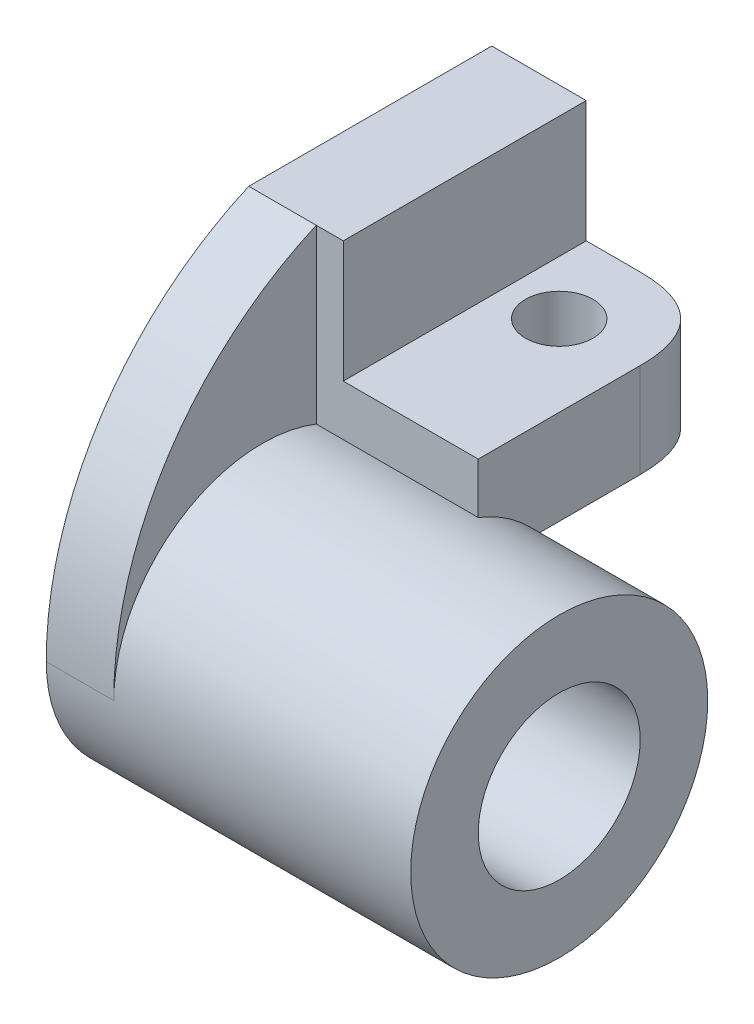
ISO-10303-21;
HEADER;
FILE_DESCRIPTION(('STEP AP214'),'2;1');
FILE_NAME('part.step','',(''),(''),'','','');
FILE_SCHEMA(('AUTOMOTIVE_DESIGN { 1 0 10303 214 1 1 1 1 }'));
ENDSEC;
DATA;
#1=APPLICATION_CONTEXT('core data for automotive mechanical design processes');
#2=APPLICATION_PROTOCOL_DEFINITION('international standard','automotive_design',2000,#1);
#3=PRODUCT_CONTEXT('',#1,'mechanical');
#4=PRODUCT('Part','Part','',(#3));
#5=PRODUCT_RELATED_PRODUCT_CATEGORY('part','',(#4));
#6=PRODUCT_DEFINITION_FORMATION('','',#4);
#7=PRODUCT_DEFINITION_CONTEXT('part definition',#1,'design');
#8=PRODUCT_DEFINITION('design','',#6,#7);
#9=PRODUCT_DEFINITION_SHAPE('','',#8);
#10=(LENGTH_UNIT() NAMED_UNIT(*) SI_UNIT(.MILLI.,.METRE.));
#11=(NAMED_UNIT(*) PLANE_ANGLE_UNIT() SI_UNIT($,.RADIAN.));
#12=(NAMED_UNIT(*) SI_UNIT($,.STERADIAN.) SOLID_ANGLE_UNIT());
#13=UNCERTAINTY_MEASURE_WITH_UNIT(LENGTH_MEASURE(1.E-05),#10,'distance_accuracy_value','');
#14=(GEOMETRIC_REPRESENTATION_CONTEXT(3) GLOBAL_UNCERTAINTY_ASSIGNED_CONTEXT((#13)) GLOBAL_UNIT_ASSIGNED_CONTEXT((#10,
#11,#12)) REPRESENTATION_CONTEXT('',''));
#15=CARTESIAN_POINT('',(0.,0.,0.));
#16=DIRECTION('',(0.,0.,1.));
#17=DIRECTION('',(1.,0.,0.));
#18=AXIS2_PLACEMENT_3D('',#15,#16,#17);
#19=CARTESIAN_POINT('',(85.725,0.,0.));
#20=DIRECTION('',(-1.,0.,0.));
#21=DIRECTION('',(0.,0.,1.));
#22=AXIS2_PLACEMENT_3D('',#19,#20,#21);
#23=CYLINDRICAL_SURFACE('',#22,19.05);
#24=CARTESIAN_POINT('',(85.725,0.,0.));
#25=DIRECTION('',(1.,0.,0.));
#26=DIRECTION('',(0.,0.,-1.));
#27=AXIS2_PLACEMENT_3D('',#24,#25,#26);
#28=CIRCLE('',#27,19.05);
#29=CARTESIAN_POINT('',(85.725,0.,-19.05));
#30=VERTEX_POINT('',#29);
#31=EDGE_CURVE('E198',#30,#30,#28,.T.);
#32=ORIENTED_EDGE('',*,*,#31,.T.);
#33=EDGE_LOOP('',(#32));
#34=FACE_BOUND('',#33,.T.);
#35=CARTESIAN_POINT('',(0.,0.,0.));
#36=DIRECTION('',(1.,0.,0.));
#37=DIRECTION('',(0.,0.,-1.));
#38=AXIS2_PLACEMENT_3D('',#35,#36,#37);
#39=CIRCLE('',#38,19.05);
#40=CARTESIAN_POINT('',(0.,0.,-19.05));
#41=VERTEX_POINT('',#40);
#42=EDGE_CURVE('E197',#41,#41,#39,.T.);
#43=ORIENTED_EDGE('',*,*,#42,.F.);
#44=EDGE_LOOP('',(#43));
#45=FACE_BOUND('',#44,.T.);
#46=ADVANCED_FACE('F40',(#34,#45),#23,.F.);
#47=CARTESIAN_POINT('',(85.725,0.,0.));
#48=DIRECTION('',(-1.,0.,0.));
#49=DIRECTION('',(0.,0.,1.));
#50=AXIS2_PLACEMENT_3D('',#47,#48,#49);
#51=CYLINDRICAL_SURFACE('',#50,34.925);
#52=CARTESIAN_POINT('',(85.725,0.,0.));
#53=DIRECTION('',(1.,0.,0.));
#54=DIRECTION('',(0.,0.,-1.));
#55=AXIS2_PLACEMENT_3D('',#52,#53,#54);
#56=CIRCLE('',#55,34.925);
#57=CARTESIAN_POINT('',(85.725,0.,-34.925));
#58=VERTEX_POINT('',#57);
#59=EDGE_CURVE('E201',#58,#58,#56,.T.);
#60=ORIENTED_EDGE('',*,*,#59,.F.);
#61=EDGE_LOOP('',(#60));
#62=FACE_BOUND('',#61,.T.);
#63=CARTESIAN_POINT('',(15.875,0.,0.));
#64=DIRECTION('',(1.,0.,0.));
#65=DIRECTION('',(0.,0.,-1.));
#66=AXIS2_PLACEMENT_3D('',#63,#64,#65);
#67=CIRCLE('',#66,34.925);
#68=CARTESIAN_POINT('',(15.875,32.5340686819217,-12.7));
#69=VERTEX_POINT('',#68);
#70=CARTESIAN_POINT('',(15.875,-1.25496401465197E-12,34.925));
#71=VERTEX_POINT('',#70);
#72=EDGE_CURVE('E152',#69,#71,#67,.T.);
#73=ORIENTED_EDGE('',*,*,#72,.T.);
#74=DIRECTION('',(-1.,0.,0.));
#75=VECTOR('',#74,1.);
#76=CARTESIAN_POINT('',(15.875,1.24130306727865E-12,34.925));
#77=LINE('',#76,#75);
#78=CARTESIAN_POINT('',(0.,1.24130306727865E-12,34.925));
#79=VERTEX_POINT('',#78);
#80=EDGE_CURVE('E132',#71,#79,#77,.T.);
#81=ORIENTED_EDGE('',*,*,#80,.T.);
#82=CARTESIAN_POINT('',(0.,0.,0.));
#83=DIRECTION('',(1.,0.,0.));
#84=DIRECTION('',(0.,0.,-1.));
#85=AXIS2_PLACEMENT_3D('',#82,#83,#84);
#86=CIRCLE('',#85,34.925);
#87=CARTESIAN_POINT('',(0.,22.225,-26.9407683632075));
#88=VERTEX_POINT('',#87);
#89=EDGE_CURVE('E149',#79,#88,#86,.T.);
#90=ORIENTED_EDGE('',*,*,#89,.T.);
#91=DIRECTION('',(-1.,0.,0.));
#92=VECTOR('',#91,1.);
#93=CARTESIAN_POINT('',(53.975,22.225,-26.9407683632075));
#94=LINE('',#93,#92);
#95=CARTESIAN_POINT('',(53.975,22.225,-26.9407683632075));
#96=VERTEX_POINT('',#95);
#97=EDGE_CURVE('E194',#96,#88,#94,.T.);
#98=ORIENTED_EDGE('',*,*,#97,.F.);
#99=CARTESIAN_POINT('',(53.975,0.,0.));
#100=DIRECTION('',(1.,0.,0.));
#101=DIRECTION('',(0.,0.,-1.));
#102=AXIS2_PLACEMENT_3D('',#99,#100,#101);
#103=CIRCLE('',#102,34.925);
#104=CARTESIAN_POINT('',(53.975,32.5340686819217,-12.7));
#105=VERTEX_POINT('',#104);
#106=EDGE_CURVE('E216',#96,#105,#103,.T.);
#107=ORIENTED_EDGE('',*,*,#106,.T.);
#108=DIRECTION('',(-1.,0.,0.));
#109=VECTOR('',#108,1.);
#110=CARTESIAN_POINT('',(53.975,32.5340686819217,-12.7));
#111=LINE('',#110,#109);
#112=EDGE_CURVE('E222',#105,#69,#111,.T.);
#113=ORIENTED_EDGE('',*,*,#112,.T.);
#114=EDGE_LOOP('',(#73,#81,#90,#98,#107,#113));
#115=FACE_BOUND('',#114,.T.);
#116=ADVANCED_FACE('F208',(#62,#115),#51,.T.);
#117=CARTESIAN_POINT('',(85.725,0.,0.));
#118=DIRECTION('',(1.,0.,0.));
#119=DIRECTION('',(0.,0.,-1.));
#120=AXIS2_PLACEMENT_3D('',#117,#118,#119);
#121=PLANE('',#120);
#122=ORIENTED_EDGE('',*,*,#31,.F.);
#123=EDGE_LOOP('',(#122));
#124=FACE_BOUND('',#123,.T.);
#125=ORIENTED_EDGE('',*,*,#59,.T.);
#126=EDGE_LOOP('',(#125));
#127=FACE_BOUND('',#126,.T.);
#128=ADVANCED_FACE('F265',(#124,#127),#121,.T.);
#129=CARTESIAN_POINT('',(0.,0.,0.));
#130=DIRECTION('',(1.,0.,0.));
#131=DIRECTION('',(0.,0.,-1.));
#132=AXIS2_PLACEMENT_3D('',#129,#130,#131);
#133=PLANE('',#132);
#134=ORIENTED_EDGE('',*,*,#89,.F.);
#135=CARTESIAN_POINT('',(0.,0.276400811942926,-44.4495187550208));
#136=DIRECTION('',(1.,0.,0.));
#137=DIRECTION('',(0.,0.,-1.));
#138=AXIS2_PLACEMENT_3D('',#135,#136,#137);
#139=CIRCLE('',#138,79.375);
#140=CARTESIAN_POINT('',(0.,73.025,-12.7));
#141=VERTEX_POINT('',#140);
#142=EDGE_CURVE('E139',#79,#141,#139,.F.);
#143=ORIENTED_EDGE('',*,*,#142,.T.);
#144=DIRECTION('',(0.,0.,-1.));
#145=VECTOR('',#144,1.);
#146=CARTESIAN_POINT('',(0.,73.025,0.));
#147=LINE('',#146,#145);
#148=CARTESIAN_POINT('',(0.,73.025,-69.85));
#149=VERTEX_POINT('',#148);
#150=EDGE_CURVE('E121',#141,#149,#147,.T.);
#151=ORIENTED_EDGE('',*,*,#150,.T.);
#152=DIRECTION('',(0.,-1.,0.));
#153=VECTOR('',#152,1.);
#154=CARTESIAN_POINT('',(0.,0.,-69.85));
#155=LINE('',#154,#153);
#156=CARTESIAN_POINT('',(0.,22.225,-69.85));
#157=VERTEX_POINT('',#156);
#158=EDGE_CURVE('E214',#149,#157,#155,.T.);
#159=ORIENTED_EDGE('',*,*,#158,.T.);
#160=DIRECTION('',(0.,0.,1.));
#161=VECTOR('',#160,1.);
#162=CARTESIAN_POINT('',(0.,22.225,0.));
#163=LINE('',#162,#161);
#164=EDGE_CURVE('E212',#157,#88,#163,.T.);
#165=ORIENTED_EDGE('',*,*,#164,.T.);
#166=EDGE_LOOP('',(#134,#143,#151,#159,#165));
#167=FACE_BOUND('',#166,.T.);
#168=ORIENTED_EDGE('',*,*,#42,.T.);
#169=EDGE_LOOP('',(#168));
#170=FACE_BOUND('',#169,.T.);
#171=ADVANCED_FACE('F146',(#167,#170),#133,.F.);
#172=CARTESIAN_POINT('',(53.975,22.225,0.));
#173=DIRECTION('',(0.,-1.,0.));
#174=DIRECTION('',(0.,0.,-1.));
#175=AXIS2_PLACEMENT_3D('',#172,#173,#174);
#176=PLANE('',#175);
#177=CARTESIAN_POINT('',(34.925,22.225,-50.8));
#178=DIRECTION('',(0.,-1.,0.));
#179=DIRECTION('',(0.,0.,-1.));
#180=AXIS2_PLACEMENT_3D('',#177,#178,#179);
#181=CIRCLE('',#180,7.9375);
#182=CARTESIAN_POINT('',(34.925,22.225,-42.8625));
#183=VERTEX_POINT('',#182);
#184=EDGE_CURVE('E150',#183,#183,#181,.T.);
#185=ORIENTED_EDGE('',*,*,#184,.F.);
#186=EDGE_LOOP('',(#185));
#187=FACE_BOUND('',#186,.T.);
#188=DIRECTION('',(-1.,0.,0.));
#189=VECTOR('',#188,1.);
#190=CARTESIAN_POINT('',(53.975,22.225,-69.85));
#191=LINE('',#190,#189);
#192=CARTESIAN_POINT('',(34.925,22.225,-69.85));
#193=VERTEX_POINT('',#192);
#194=EDGE_CURVE('E186',#193,#157,#191,.T.);
#195=ORIENTED_EDGE('',*,*,#194,.F.);
#196=CARTESIAN_POINT('',(53.975,22.225,-50.8));
#197=CARTESIAN_POINT('',(53.975,22.225,-69.85));
#198=CARTESIAN_POINT('',(34.925,22.225,-69.85));
#199=(BOUNDED_CURVE() B_SPLINE_CURVE(2,(#196,#197,#198),.UNSPECIFIED.,.F.,
.F.) B_SPLINE_CURVE_WITH_KNOTS((3,3),(0.,1.),
.UNSPECIFIED.) CURVE() GEOMETRIC_REPRESENTATION_ITEM() RATIONAL_B_SPLINE_CURVE((1.,1.,1.)) REPRESENTATION_ITEM(''));
#200=CARTESIAN_POINT('',(53.975,22.225,-50.8));
#201=VERTEX_POINT('',#200);
#202=EDGE_CURVE('E69',#193,#201,#199,.F.);
#203=ORIENTED_EDGE('',*,*,#202,.T.);
#204=DIRECTION('',(0.,0.,1.));
#205=VECTOR('',#204,1.);
#206=CARTESIAN_POINT('',(53.975,22.225,0.));
#207=LINE('',#206,#205);
#208=EDGE_CURVE('E213',#201,#96,#207,.T.);
#209=ORIENTED_EDGE('',*,*,#208,.T.);
#210=ORIENTED_EDGE('',*,*,#97,.T.);
#211=ORIENTED_EDGE('',*,*,#164,.F.);
#212=EDGE_LOOP('',(#195,#203,#209,#210,#211));
#213=FACE_BOUND('',#212,.T.);
#214=ADVANCED_FACE('F211',(#187,#213),#176,.T.);
#215=CARTESIAN_POINT('',(53.975,0.,-69.85));
#216=DIRECTION('',(0.,0.,-1.));
#217=DIRECTION('',(-1.,0.,0.));
#218=AXIS2_PLACEMENT_3D('',#215,#216,#217);
#219=PLANE('',#218);
#220=DIRECTION('',(-1.,0.,0.));
#221=VECTOR('',#220,1.);
#222=CARTESIAN_POINT('',(53.975,44.45,-69.85));
#223=LINE('',#222,#221);
#224=CARTESIAN_POINT('',(34.925,44.45,-69.85));
#225=VERTEX_POINT('',#224);
#226=CARTESIAN_POINT('',(22.225,44.45,-69.85));
#227=VERTEX_POINT('',#226);
#228=EDGE_CURVE('E183',#225,#227,#223,.T.);
#229=ORIENTED_EDGE('',*,*,#228,.F.);
#230=CARTESIAN_POINT('',(34.925,21.11375,-69.85));
#231=CARTESIAN_POINT('',(34.925,29.2629166666666,-69.85));
#232=CARTESIAN_POINT('',(34.925,37.4120833333333,-69.85));
#233=CARTESIAN_POINT('',(34.925,45.56125,-69.85));
#234=(BOUNDED_CURVE() B_SPLINE_CURVE(3,(#230,#231,#232,#233),.UNSPECIFIED.,.F.,
.F.) B_SPLINE_CURVE_WITH_KNOTS((4,4),(-0.04556125,-0.02111375),
.UNSPECIFIED.) CURVE() GEOMETRIC_REPRESENTATION_ITEM() RATIONAL_B_SPLINE_CURVE((1.,1.,1.,1.)) REPRESENTATION_ITEM(''));
#235=EDGE_CURVE('E204',#225,#193,#234,.F.);
#236=ORIENTED_EDGE('',*,*,#235,.T.);
#237=ORIENTED_EDGE('',*,*,#194,.T.);
#238=ORIENTED_EDGE('',*,*,#158,.F.);
#239=DIRECTION('',(-1.,0.,0.));
#240=VECTOR('',#239,1.);
#241=CARTESIAN_POINT('',(22.225,73.025,-69.85));
#242=LINE('',#241,#240);
#243=CARTESIAN_POINT('',(22.225,73.025,-69.85));
#244=VERTEX_POINT('',#243);
#245=EDGE_CURVE('E127',#244,#149,#242,.T.);
#246=ORIENTED_EDGE('',*,*,#245,.F.);
#247=DIRECTION('',(0.,-1.,0.));
#248=VECTOR('',#247,1.);
#249=CARTESIAN_POINT('',(22.225,0.,-69.85));
#250=LINE('',#249,#248);
#251=EDGE_CURVE('E131',#244,#227,#250,.T.);
#252=ORIENTED_EDGE('',*,*,#251,.T.);
#253=EDGE_LOOP('',(#229,#236,#237,#238,#246,#252));
#254=FACE_BOUND('',#253,.T.);
#255=ADVANCED_FACE('F248',(#254),#219,.T.);
#256=CARTESIAN_POINT('',(53.975,44.45,0.));
#257=DIRECTION('',(0.,1.,0.));
#258=DIRECTION('',(0.,0.,1.));
#259=AXIS2_PLACEMENT_3D('',#256,#257,#258);
#260=PLANE('',#259);
#261=CARTESIAN_POINT('',(34.925,44.45,-50.8));
#262=DIRECTION('',(0.,1.,0.));
#263=DIRECTION('',(0.,0.,1.));
#264=AXIS2_PLACEMENT_3D('',#261,#262,#263);
#265=CIRCLE('',#264,7.9375);
#266=CARTESIAN_POINT('',(34.925,44.45,-42.8625));
#267=VERTEX_POINT('',#266);
#268=EDGE_CURVE('E155',#267,#267,#265,.T.);
#269=ORIENTED_EDGE('',*,*,#268,.F.);
#270=EDGE_LOOP('',(#269));
#271=FACE_BOUND('',#270,.T.);
#272=DIRECTION('',(0.,0.,-1.));
#273=VECTOR('',#272,1.);
#274=CARTESIAN_POINT('',(53.975,44.45,0.));
#275=LINE('',#274,#273);
#276=CARTESIAN_POINT('',(53.975,44.45,-12.7));
#277=VERTEX_POINT('',#276);
#278=CARTESIAN_POINT('',(53.975,44.45,-50.8));
#279=VERTEX_POINT('',#278);
#280=EDGE_CURVE('E228',#277,#279,#275,.T.);
#281=ORIENTED_EDGE('',*,*,#280,.T.);
#282=CARTESIAN_POINT('',(34.925,44.45,-69.85));
#283=CARTESIAN_POINT('',(53.975,44.45,-69.85));
#284=CARTESIAN_POINT('',(53.975,44.45,-50.8));
#285=(BOUNDED_CURVE() B_SPLINE_CURVE(2,(#282,#283,#284),.UNSPECIFIED.,.F.,
.F.) B_SPLINE_CURVE_WITH_KNOTS((3,3),(0.,1.),
.UNSPECIFIED.) CURVE() GEOMETRIC_REPRESENTATION_ITEM() RATIONAL_B_SPLINE_CURVE((1.,1.,1.)) REPRESENTATION_ITEM(''));
#286=EDGE_CURVE('E12',#279,#225,#285,.F.);
#287=ORIENTED_EDGE('',*,*,#286,.T.);
#288=ORIENTED_EDGE('',*,*,#228,.T.);
#289=DIRECTION('',(0.,0.,-1.));
#290=VECTOR('',#289,1.);
#291=CARTESIAN_POINT('',(22.225,44.45,0.));
#292=LINE('',#291,#290);
#293=CARTESIAN_POINT('',(22.225,44.45,-12.7));
#294=VERTEX_POINT('',#293);
#295=EDGE_CURVE('E167',#294,#227,#292,.T.);
#296=ORIENTED_EDGE('',*,*,#295,.F.);
#297=DIRECTION('',(-1.,0.,0.));
#298=VECTOR('',#297,1.);
#299=CARTESIAN_POINT('',(53.975,44.45,-12.7));
#300=LINE('',#299,#298);
#301=EDGE_CURVE('E172',#277,#294,#300,.T.);
#302=ORIENTED_EDGE('',*,*,#301,.F.);
#303=EDGE_LOOP('',(#281,#287,#288,#296,#302));
#304=FACE_BOUND('',#303,.T.);
#305=ADVANCED_FACE('F257',(#271,#304),#260,.T.);
#306=CARTESIAN_POINT('',(53.975,0.,-12.7));
#307=DIRECTION('',(0.,0.,-1.));
#308=DIRECTION('',(-1.,0.,0.));
#309=AXIS2_PLACEMENT_3D('',#306,#307,#308);
#310=PLANE('',#309);
#311=DIRECTION('',(-1.,0.,0.));
#312=VECTOR('',#311,1.);
#313=CARTESIAN_POINT('',(22.225,73.025,-12.7));
#314=LINE('',#313,#312);
#315=CARTESIAN_POINT('',(22.225,73.025,-12.7));
#316=VERTEX_POINT('',#315);
#317=CARTESIAN_POINT('',(15.875,73.025,-12.7));
#318=VERTEX_POINT('',#317);
#319=EDGE_CURVE('E171',#316,#318,#314,.T.);
#320=ORIENTED_EDGE('',*,*,#319,.T.);
#321=DIRECTION('',(0.,-1.,0.));
#322=VECTOR('',#321,1.);
#323=CARTESIAN_POINT('',(15.875,0.,-12.7));
#324=LINE('',#323,#322);
#325=EDGE_CURVE('E143',#318,#69,#324,.T.);
#326=ORIENTED_EDGE('',*,*,#325,.T.);
#327=ORIENTED_EDGE('',*,*,#112,.F.);
#328=DIRECTION('',(0.,-1.,0.));
#329=VECTOR('',#328,1.);
#330=CARTESIAN_POINT('',(53.975,0.,-12.7));
#331=LINE('',#330,#329);
#332=EDGE_CURVE('E220',#277,#105,#331,.T.);
#333=ORIENTED_EDGE('',*,*,#332,.F.);
#334=ORIENTED_EDGE('',*,*,#301,.T.);
#335=DIRECTION('',(0.,1.,0.));
#336=VECTOR('',#335,1.);
#337=CARTESIAN_POINT('',(22.225,0.,-12.7));
#338=LINE('',#337,#336);
#339=EDGE_CURVE('E163',#294,#316,#338,.T.);
#340=ORIENTED_EDGE('',*,*,#339,.T.);
#341=EDGE_LOOP('',(#320,#326,#327,#333,#334,#340));
#342=FACE_BOUND('',#341,.T.);
#343=ADVANCED_FACE('F313',(#342),#310,.F.);
#344=CARTESIAN_POINT('',(53.975,0.,0.));
#345=DIRECTION('',(1.,0.,0.));
#346=DIRECTION('',(0.,0.,-1.));
#347=AXIS2_PLACEMENT_3D('',#344,#345,#346);
#348=PLANE('',#347);
#349=ORIENTED_EDGE('',*,*,#208,.F.);
#350=CARTESIAN_POINT('',(53.975,45.56125,-50.8));
#351=CARTESIAN_POINT('',(53.975,37.4120833333333,-50.8));
#352=CARTESIAN_POINT('',(53.975,29.2629166666666,-50.8));
#353=CARTESIAN_POINT('',(53.975,21.11375,-50.8));
#354=(BOUNDED_CURVE() B_SPLINE_CURVE(3,(#350,#351,#352,#353),.UNSPECIFIED.,.F.,
.F.) B_SPLINE_CURVE_WITH_KNOTS((4,4),(-0.04556125,-0.02111375),
.UNSPECIFIED.) CURVE() GEOMETRIC_REPRESENTATION_ITEM() RATIONAL_B_SPLINE_CURVE((1.,1.,1.,1.)) REPRESENTATION_ITEM(''));
#355=EDGE_CURVE('E54',#201,#279,#354,.F.);
#356=ORIENTED_EDGE('',*,*,#355,.T.);
#357=ORIENTED_EDGE('',*,*,#280,.F.);
#358=ORIENTED_EDGE('',*,*,#332,.T.);
#359=ORIENTED_EDGE('',*,*,#106,.F.);
#360=EDGE_LOOP('',(#349,#356,#357,#358,#359));
#361=FACE_BOUND('',#360,.T.);
#362=ADVANCED_FACE('F320',(#361),#348,.T.);
#363=CARTESIAN_POINT('',(22.225,73.025,0.));
#364=DIRECTION('',(0.,1.,0.));
#365=DIRECTION('',(0.,0.,1.));
#366=AXIS2_PLACEMENT_3D('',#363,#364,#365);
#367=PLANE('',#366);
#368=ORIENTED_EDGE('',*,*,#150,.F.);
#369=DIRECTION('',(-1.,0.,0.));
#370=VECTOR('',#369,1.);
#371=CARTESIAN_POINT('',(15.875,73.025,-12.7));
#372=LINE('',#371,#370);
#373=EDGE_CURVE('E124',#318,#141,#372,.T.);
#374=ORIENTED_EDGE('',*,*,#373,.F.);
#375=ORIENTED_EDGE('',*,*,#319,.F.);
#376=DIRECTION('',(0.,0.,-1.));
#377=VECTOR('',#376,1.);
#378=CARTESIAN_POINT('',(22.225,73.025,0.));
#379=LINE('',#378,#377);
#380=EDGE_CURVE('E161',#316,#244,#379,.T.);
#381=ORIENTED_EDGE('',*,*,#380,.T.);
#382=ORIENTED_EDGE('',*,*,#245,.T.);
#383=EDGE_LOOP('',(#368,#374,#375,#381,#382));
#384=FACE_BOUND('',#383,.T.);
#385=ADVANCED_FACE('F123',(#384),#367,.T.);
#386=CARTESIAN_POINT('',(22.225,0.,0.));
#387=DIRECTION('',(1.,0.,0.));
#388=DIRECTION('',(0.,0.,-1.));
#389=AXIS2_PLACEMENT_3D('',#386,#387,#388);
#390=PLANE('',#389);
#391=ORIENTED_EDGE('',*,*,#251,.F.);
#392=ORIENTED_EDGE('',*,*,#380,.F.);
#393=ORIENTED_EDGE('',*,*,#339,.F.);
#394=ORIENTED_EDGE('',*,*,#295,.T.);
#395=EDGE_LOOP('',(#391,#392,#393,#394));
#396=FACE_BOUND('',#395,.T.);
#397=ADVANCED_FACE('F332',(#396),#390,.T.);
#398=CARTESIAN_POINT('',(15.875,0.276400811942926,-44.4495187550208));
#399=DIRECTION('',(-1.,0.,0.));
#400=DIRECTION('',(0.,0.,1.));
#401=AXIS2_PLACEMENT_3D('',#398,#399,#400);
#402=CYLINDRICAL_SURFACE('',#401,79.375);
#403=ORIENTED_EDGE('',*,*,#142,.F.);
#404=ORIENTED_EDGE('',*,*,#80,.F.);
#405=CARTESIAN_POINT('',(15.875,0.276400811942926,-44.4495187550208));
#406=DIRECTION('',(1.,0.,0.));
#407=DIRECTION('',(0.,0.,-1.));
#408=AXIS2_PLACEMENT_3D('',#405,#406,#407);
#409=CIRCLE('',#408,79.375);
#410=EDGE_CURVE('E141',#71,#318,#409,.F.);
#411=ORIENTED_EDGE('',*,*,#410,.T.);
#412=ORIENTED_EDGE('',*,*,#373,.T.);
#413=EDGE_LOOP('',(#403,#404,#411,#412));
#414=FACE_BOUND('',#413,.T.);
#415=ADVANCED_FACE('F137',(#414),#402,.T.);
#416=CARTESIAN_POINT('',(15.875,0.,0.));
#417=DIRECTION('',(1.,0.,0.));
#418=DIRECTION('',(0.,0.,-1.));
#419=AXIS2_PLACEMENT_3D('',#416,#417,#418);
#420=PLANE('',#419);
#421=ORIENTED_EDGE('',*,*,#410,.F.);
#422=ORIENTED_EDGE('',*,*,#72,.F.);
#423=ORIENTED_EDGE('',*,*,#325,.F.);
#424=EDGE_LOOP('',(#421,#422,#423));
#425=FACE_BOUND('',#424,.T.);
#426=ADVANCED_FACE('F345',(#425),#420,.T.);
#427=CARTESIAN_POINT('',(34.925,45.56125,-69.85));
#428=CARTESIAN_POINT('',(34.925,37.4120833333333,-69.85));
#429=CARTESIAN_POINT('',(34.925,29.2629166666666,-69.85));
#430=CARTESIAN_POINT('',(34.925,21.11375,-69.85));
#431=CARTESIAN_POINT('',(53.975,45.56125,-69.85));
#432=CARTESIAN_POINT('',(53.975,37.4120833333334,-69.85));
#433=CARTESIAN_POINT('',(53.975,29.2629166666666,-69.85));
#434=CARTESIAN_POINT('',(53.975,21.11375,-69.85));
#435=CARTESIAN_POINT('',(53.975,45.56125,-50.8));
#436=CARTESIAN_POINT('',(53.975,37.4120833333333,-50.8));
#437=CARTESIAN_POINT('',(53.975,29.2629166666666,-50.8));
#438=CARTESIAN_POINT('',(53.975,21.11375,-50.8));
#439=(BOUNDED_SURFACE() B_SPLINE_SURFACE(2,3,((#427,#428,#429,#430),(#431,#432,#433,#434),(#435,
#436,#437,#438)),.UNSPECIFIED.,.F.,.F.,.F.) B_SPLINE_SURFACE_WITH_KNOTS((3,3),(4,4),(0.,1.),
(-0.04556125,-0.02111375),
.UNSPECIFIED.) GEOMETRIC_REPRESENTATION_ITEM() RATIONAL_B_SPLINE_SURFACE(((1.,1.,1.,1.),(1.,1.,
1.,1.),(1.,1.,1.,1.))) REPRESENTATION_ITEM('') SURFACE());
#440=ORIENTED_EDGE('',*,*,#286,.F.);
#441=ORIENTED_EDGE('',*,*,#355,.F.);
#442=ORIENTED_EDGE('',*,*,#202,.F.);
#443=ORIENTED_EDGE('',*,*,#235,.F.);
#444=EDGE_LOOP('',(#440,#441,#442,#443));
#445=FACE_BOUND('',#444,.T.);
#446=ADVANCED_FACE('F43',(#445),#439,.T.);
#447=CARTESIAN_POINT('',(34.925,-34.925,-50.8));
#448=DIRECTION('',(0.,1.,0.));
#449=DIRECTION('',(0.,0.,1.));
#450=AXIS2_PLACEMENT_3D('',#447,#448,#449);
#451=CYLINDRICAL_SURFACE('',#450,7.9375);
#452=CARTESIAN_POINT('',(34.925,22.225,-42.8625));
#453=CARTESIAN_POINT('',(34.925,22.4565104166667,-42.8625));
#454=CARTESIAN_POINT('',(34.925,22.6880208333333,-42.8625));
#455=CARTESIAN_POINT('',(34.925,23.1510416666667,-42.8625));
#456=CARTESIAN_POINT('',(34.925,23.3825520833333,-42.8625));
#457=CARTESIAN_POINT('',(34.925,23.8455729166667,-42.8625));
#458=CARTESIAN_POINT('',(34.925,24.0770833333333,-42.8625));
#459=CARTESIAN_POINT('',(34.925,24.5401041666667,-42.8625));
#460=CARTESIAN_POINT('',(34.925,24.7716145833333,-42.8625));
#461=CARTESIAN_POINT('',(34.925,25.2346354166667,-42.8625));
#462=CARTESIAN_POINT('',(34.925,25.4661458333333,-42.8625));
#463=CARTESIAN_POINT('',(34.925,25.9291666666667,-42.8625));
#464=CARTESIAN_POINT('',(34.925,26.1606770833333,-42.8625));
#465=CARTESIAN_POINT('',(34.925,26.6236979166667,-42.8625));
#466=CARTESIAN_POINT('',(34.925,26.8552083333333,-42.8625));
#467=CARTESIAN_POINT('',(34.925,27.3182291666667,-42.8625));
#468=CARTESIAN_POINT('',(34.925,27.5497395833333,-42.8625));
#469=CARTESIAN_POINT('',(34.925,28.0127604166667,-42.8625));
#470=CARTESIAN_POINT('',(34.925,28.2442708333333,-42.8625));
#471=CARTESIAN_POINT('',(34.925,28.7072916666667,-42.8625));
#472=CARTESIAN_POINT('',(34.925,28.9388020833333,-42.8625));
#473=CARTESIAN_POINT('',(34.925,29.4018229166666,-42.8625));
#474=CARTESIAN_POINT('',(34.925,29.6333333333333,-42.8625));
#475=CARTESIAN_POINT('',(34.925,30.0963541666667,-42.8625));
#476=CARTESIAN_POINT('',(34.925,30.3278645833333,-42.8625));
#477=CARTESIAN_POINT('',(34.925,30.7908854166667,-42.8625));
#478=CARTESIAN_POINT('',(34.925,31.0223958333333,-42.8625));
#479=CARTESIAN_POINT('',(34.925,31.4854166666667,-42.8625));
#480=CARTESIAN_POINT('',(34.925,31.7169270833333,-42.8625));
#481=CARTESIAN_POINT('',(34.925,32.1799479166667,-42.8625));
#482=CARTESIAN_POINT('',(34.925,32.4114583333333,-42.8625));
#483=CARTESIAN_POINT('',(34.925,32.8744791666667,-42.8625));
#484=CARTESIAN_POINT('',(34.925,33.1059895833333,-42.8625));
#485=CARTESIAN_POINT('',(34.925,33.5690104166667,-42.8625));
#486=CARTESIAN_POINT('',(34.925,33.8005208333333,-42.8625));
#487=CARTESIAN_POINT('',(34.925,34.2635416666667,-42.8625));
#488=CARTESIAN_POINT('',(34.925,34.4950520833333,-42.8625));
#489=CARTESIAN_POINT('',(34.925,34.9580729166667,-42.8625));
#490=CARTESIAN_POINT('',(34.925,35.1895833333333,-42.8625));
#491=CARTESIAN_POINT('',(34.925,35.6526041666666,-42.8625));
#492=CARTESIAN_POINT('',(34.925,35.8841145833333,-42.8625));
#493=CARTESIAN_POINT('',(34.925,36.3471354166666,-42.8625));
#494=CARTESIAN_POINT('',(34.925,36.5786458333333,-42.8625));
#495=CARTESIAN_POINT('',(34.925,37.0416666666667,-42.8625));
#496=CARTESIAN_POINT('',(34.925,37.2731770833333,-42.8625));
#497=CARTESIAN_POINT('',(34.925,37.7361979166667,-42.8625));
#498=CARTESIAN_POINT('',(34.925,37.9677083333333,-42.8625));
#499=CARTESIAN_POINT('',(34.925,38.4307291666667,-42.8625));
#500=CARTESIAN_POINT('',(34.925,38.6622395833333,-42.8625));
#501=CARTESIAN_POINT('',(34.925,39.1252604166667,-42.8625));
#502=CARTESIAN_POINT('',(34.925,39.3567708333333,-42.8625));
#503=CARTESIAN_POINT('',(34.925,39.8197916666667,-42.8625));
#504=CARTESIAN_POINT('',(34.925,40.0513020833333,-42.8625));
#505=CARTESIAN_POINT('',(34.925,40.5143229166667,-42.8625));
#506=CARTESIAN_POINT('',(34.925,40.7458333333333,-42.8625));
#507=CARTESIAN_POINT('',(34.925,41.2088541666667,-42.8625));
#508=CARTESIAN_POINT('',(34.925,41.4403645833333,-42.8625));
#509=CARTESIAN_POINT('',(34.925,41.9033854166667,-42.8625));
#510=CARTESIAN_POINT('',(34.925,42.1348958333333,-42.8625));
#511=CARTESIAN_POINT('',(34.925,42.5979166666666,-42.8625));
#512=CARTESIAN_POINT('',(34.925,42.8294270833333,-42.8625));
#513=CARTESIAN_POINT('',(34.925,43.2924479166667,-42.8625));
#514=CARTESIAN_POINT('',(34.925,43.5239583333333,-42.8625));
#515=CARTESIAN_POINT('',(34.925,43.9869791666667,-42.8625));
#516=CARTESIAN_POINT('',(34.925,44.2184895833333,-42.8625));
#517=CARTESIAN_POINT('',(34.925,44.45,-42.8625));
#518=B_SPLINE_CURVE_WITH_KNOTS('',3,(#452,#453,#454,#455,#456,#457,#458,#459,#460,#461,#462,
#463,#464,#465,#466,#467,#468,#469,#470,#471,#472,#473,#474,#475,#476,#477,#478,#479,#480,#481,
#482,#483,#484,#485,#486,#487,#488,#489,#490,#491,#492,#493,#494,#495,#496,#497,#498,#499,#500,
#501,#502,#503,#504,#505,#506,#507,#508,#509,#510,#511,#512,#513,#514,#515,#516,#517),
.UNSPECIFIED.,.F.,.F.,(4,2,2,2,2,2,2,2,2,2,2,2,2,2,2,2,2,2,2,2,2,2,2,2,2,2,2,2,2,2,2,2,4),(0.,
0.694531249999998,1.3890625,2.08359375,2.778125,3.47265625,4.1671875,4.86171875,
5.55624999999999,6.25078125,6.94531249999999,7.63984374999999,8.334375,9.02890624999999,
9.72343749999999,10.41796875,11.1125,11.80703125,12.5015625,13.19609375,13.890625,14.58515625,
15.2796875,15.97421875,16.66875,17.36328125,18.0578125,18.75234375,19.446875,20.14140625,
20.8359375,21.53046875,22.225),.UNSPECIFIED.);
#519=EDGE_CURVE('BSEAM357',#183,#267,#518,.T.);
#520=ORIENTED_EDGE('',*,*,#184,.T.);
#521=ORIENTED_EDGE('',*,*,#268,.T.);
#522=ORIENTED_EDGE('',*,*,#519,.T.);
#523=ORIENTED_EDGE('',*,*,#519,.F.);
#524=EDGE_LOOP('',(#520,#522,#521,#523));
#525=FACE_BOUND('',#524,.T.);
#526=ADVANCED_FACE('F357',(#525),#451,.F.);
#527=CLOSED_SHELL('',(#46,#116,#128,#171,#214,#255,#305,#343,#362,#385,#397,#415,#426,#446,#526));
#528=MANIFOLD_SOLID_BREP('B2',#527);
#529=ADVANCED_BREP_SHAPE_REPRESENTATION('',(#18,#528),#14);
#530=SHAPE_DEFINITION_REPRESENTATION(#9,#529);
ENDSEC;
END-ISO-10303-21;
